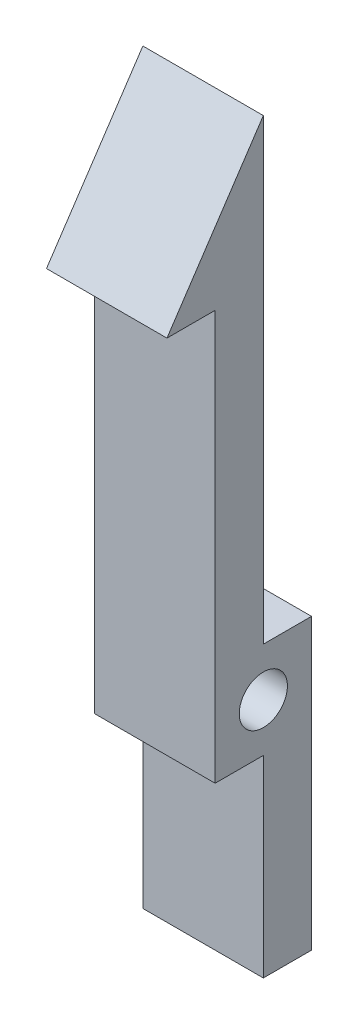
ISO-10303-21;
HEADER;
FILE_DESCRIPTION(('STEP AP214'),'2;1');
FILE_NAME('part.step','',(''),(''),'','','');
FILE_SCHEMA(('AUTOMOTIVE_DESIGN { 1 0 10303 214 1 1 1 1 }'));
ENDSEC;
DATA;
#1=APPLICATION_CONTEXT('core data for automotive mechanical design processes');
#2=APPLICATION_PROTOCOL_DEFINITION('international standard','automotive_design',2000,#1);
#3=PRODUCT_CONTEXT('',#1,'mechanical');
#4=PRODUCT('Part','Part','',(#3));
#5=PRODUCT_RELATED_PRODUCT_CATEGORY('part','',(#4));
#6=PRODUCT_DEFINITION_FORMATION('','',#4);
#7=PRODUCT_DEFINITION_CONTEXT('part definition',#1,'design');
#8=PRODUCT_DEFINITION('design','',#6,#7);
#9=PRODUCT_DEFINITION_SHAPE('','',#8);
#10=(LENGTH_UNIT() NAMED_UNIT(*) SI_UNIT(.MILLI.,.METRE.));
#11=(NAMED_UNIT(*) PLANE_ANGLE_UNIT() SI_UNIT($,.RADIAN.));
#12=(NAMED_UNIT(*) SI_UNIT($,.STERADIAN.) SOLID_ANGLE_UNIT());
#13=UNCERTAINTY_MEASURE_WITH_UNIT(LENGTH_MEASURE(1.E-05),#10,'distance_accuracy_value','');
#14=(GEOMETRIC_REPRESENTATION_CONTEXT(3) GLOBAL_UNCERTAINTY_ASSIGNED_CONTEXT((#13)) GLOBAL_UNIT_ASSIGNED_CONTEXT((#10,
#11,#12)) REPRESENTATION_CONTEXT('',''));
#15=CARTESIAN_POINT('',(0.,0.,0.));
#16=DIRECTION('',(0.,0.,1.));
#17=DIRECTION('',(1.,0.,0.));
#18=AXIS2_PLACEMENT_3D('',#15,#16,#17);
#19=CARTESIAN_POINT('',(-2.5,15.,4.));
#20=DIRECTION('',(0.,-1.,0.));
#21=DIRECTION('',(0.,0.,-1.));
#22=AXIS2_PLACEMENT_3D('',#19,#20,#21);
#23=PLANE('',#22);
#24=DIRECTION('',(0.,0.,-1.));
#25=VECTOR('',#24,1.);
#26=CARTESIAN_POINT('',(2.5,15.,4.));
#27=LINE('',#26,#25);
#28=CARTESIAN_POINT('',(2.5,15.,4.));
#29=VERTEX_POINT('',#28);
#30=CARTESIAN_POINT('',(2.5,15.,2.));
#31=VERTEX_POINT('',#30);
#32=EDGE_CURVE('E134',#29,#31,#27,.T.);
#33=ORIENTED_EDGE('',*,*,#32,.F.);
#34=DIRECTION('',(1.,0.,0.));
#35=VECTOR('',#34,1.);
#36=CARTESIAN_POINT('',(-2.5,15.,4.));
#37=LINE('',#36,#35);
#38=CARTESIAN_POINT('',(-2.5,15.,4.));
#39=VERTEX_POINT('',#38);
#40=EDGE_CURVE('E11',#39,#29,#37,.T.);
#41=ORIENTED_EDGE('',*,*,#40,.F.);
#42=DIRECTION('',(0.,0.,-1.));
#43=VECTOR('',#42,1.);
#44=CARTESIAN_POINT('',(-2.5,15.,4.));
#45=LINE('',#44,#43);
#46=CARTESIAN_POINT('',(-2.5,15.,2.));
#47=VERTEX_POINT('',#46);
#48=EDGE_CURVE('E158',#39,#47,#45,.T.);
#49=ORIENTED_EDGE('',*,*,#48,.T.);
#50=DIRECTION('',(1.,0.,0.));
#51=VECTOR('',#50,1.);
#52=CARTESIAN_POINT('',(-2.5,15.,2.));
#53=LINE('',#52,#51);
#54=EDGE_CURVE('E34',#47,#31,#53,.T.);
#55=ORIENTED_EDGE('',*,*,#54,.T.);
#56=EDGE_LOOP('',(#33,#41,#49,#55));
#57=FACE_BOUND('',#56,.T.);
#58=ADVANCED_FACE('F31',(#57),#23,.T.);
#59=CARTESIAN_POINT('',(-2.5,21.,0.));
#60=DIRECTION('',(0.,0.554700196225229,0.832050294337843));
#61=DIRECTION('',(0.,-0.832050294337843,0.554700196225229));
#62=AXIS2_PLACEMENT_3D('',#59,#60,#61);
#63=PLANE('',#62);
#64=DIRECTION('',(0.,-0.832050294337844,0.554700196225229));
#65=VECTOR('',#64,1.);
#66=CARTESIAN_POINT('',(2.5,21.,0.));
#67=LINE('',#66,#65);
#68=CARTESIAN_POINT('',(2.5,21.,0.));
#69=VERTEX_POINT('',#68);
#70=EDGE_CURVE('E156',#69,#29,#67,.T.);
#71=ORIENTED_EDGE('',*,*,#70,.F.);
#72=DIRECTION('',(1.,0.,0.));
#73=VECTOR('',#72,1.);
#74=CARTESIAN_POINT('',(-2.5,21.,0.));
#75=LINE('',#74,#73);
#76=CARTESIAN_POINT('',(-2.5,21.,0.));
#77=VERTEX_POINT('',#76);
#78=EDGE_CURVE('E40',#77,#69,#75,.T.);
#79=ORIENTED_EDGE('',*,*,#78,.F.);
#80=DIRECTION('',(0.,-0.832050294337844,0.554700196225229));
#81=VECTOR('',#80,1.);
#82=CARTESIAN_POINT('',(-2.5,21.,0.));
#83=LINE('',#82,#81);
#84=EDGE_CURVE('E124',#77,#39,#83,.T.);
#85=ORIENTED_EDGE('',*,*,#84,.T.);
#86=ORIENTED_EDGE('',*,*,#40,.T.);
#87=EDGE_LOOP('',(#71,#79,#85,#86));
#88=FACE_BOUND('',#87,.T.);
#89=ADVANCED_FACE('F172',(#88),#63,.T.);
#90=CARTESIAN_POINT('',(-2.5,2.,0.));
#91=DIRECTION('',(0.,0.,-1.));
#92=DIRECTION('',(-1.,0.,0.));
#93=AXIS2_PLACEMENT_3D('',#90,#91,#92);
#94=PLANE('',#93);
#95=DIRECTION('',(0.,1.,0.));
#96=VECTOR('',#95,1.);
#97=CARTESIAN_POINT('',(2.5,2.,0.));
#98=LINE('',#97,#96);
#99=CARTESIAN_POINT('',(2.5,2.,0.));
#100=VERTEX_POINT('',#99);
#101=EDGE_CURVE('E111',#100,#69,#98,.T.);
#102=ORIENTED_EDGE('',*,*,#101,.F.);
#103=DIRECTION('',(1.,0.,0.));
#104=VECTOR('',#103,1.);
#105=CARTESIAN_POINT('',(-2.5,2.,0.));
#106=LINE('',#105,#104);
#107=CARTESIAN_POINT('',(-2.5,2.,0.));
#108=VERTEX_POINT('',#107);
#109=EDGE_CURVE('E106',#108,#100,#106,.T.);
#110=ORIENTED_EDGE('',*,*,#109,.F.);
#111=DIRECTION('',(0.,1.,0.));
#112=VECTOR('',#111,1.);
#113=CARTESIAN_POINT('',(-2.5,2.,0.));
#114=LINE('',#113,#112);
#115=EDGE_CURVE('E109',#108,#77,#114,.T.);
#116=ORIENTED_EDGE('',*,*,#115,.T.);
#117=ORIENTED_EDGE('',*,*,#78,.T.);
#118=EDGE_LOOP('',(#102,#110,#116,#117));
#119=FACE_BOUND('',#118,.T.);
#120=ADVANCED_FACE('F108',(#119),#94,.T.);
#121=CARTESIAN_POINT('',(-2.5,2.,-2.));
#122=DIRECTION('',(0.,1.,0.));
#123=DIRECTION('',(0.,0.,1.));
#124=AXIS2_PLACEMENT_3D('',#121,#122,#123);
#125=PLANE('',#124);
#126=DIRECTION('',(0.,0.,1.));
#127=VECTOR('',#126,1.);
#128=CARTESIAN_POINT('',(2.5,2.,-2.));
#129=LINE('',#128,#127);
#130=CARTESIAN_POINT('',(2.5,2.,-2.));
#131=VERTEX_POINT('',#130);
#132=EDGE_CURVE('E153',#131,#100,#129,.T.);
#133=ORIENTED_EDGE('',*,*,#132,.F.);
#134=DIRECTION('',(1.,0.,0.));
#135=VECTOR('',#134,1.);
#136=CARTESIAN_POINT('',(-2.5,2.,-2.));
#137=LINE('',#136,#135);
#138=CARTESIAN_POINT('',(-2.5,2.,-2.));
#139=VERTEX_POINT('',#138);
#140=EDGE_CURVE('E116',#139,#131,#137,.T.);
#141=ORIENTED_EDGE('',*,*,#140,.F.);
#142=DIRECTION('',(0.,0.,1.));
#143=VECTOR('',#142,1.);
#144=CARTESIAN_POINT('',(-2.5,2.,-2.));
#145=LINE('',#144,#143);
#146=EDGE_CURVE('E122',#139,#108,#145,.T.);
#147=ORIENTED_EDGE('',*,*,#146,.T.);
#148=ORIENTED_EDGE('',*,*,#109,.T.);
#149=EDGE_LOOP('',(#133,#141,#147,#148));
#150=FACE_BOUND('',#149,.T.);
#151=ADVANCED_FACE('F126',(#150),#125,.T.);
#152=CARTESIAN_POINT('',(-2.5,-10.,-2.));
#153=DIRECTION('',(0.,0.,-1.));
#154=DIRECTION('',(-1.,0.,0.));
#155=AXIS2_PLACEMENT_3D('',#152,#153,#154);
#156=PLANE('',#155);
#157=DIRECTION('',(0.,1.,0.));
#158=VECTOR('',#157,1.);
#159=CARTESIAN_POINT('',(2.5,-10.,-2.));
#160=LINE('',#159,#158);
#161=CARTESIAN_POINT('',(2.5,-10.,-2.));
#162=VERTEX_POINT('',#161);
#163=EDGE_CURVE('E150',#162,#131,#160,.T.);
#164=ORIENTED_EDGE('',*,*,#163,.F.);
#165=DIRECTION('',(1.,0.,0.));
#166=VECTOR('',#165,1.);
#167=CARTESIAN_POINT('',(-2.5,-10.,-2.));
#168=LINE('',#167,#166);
#169=CARTESIAN_POINT('',(-2.5,-10.,-2.));
#170=VERTEX_POINT('',#169);
#171=EDGE_CURVE('E162',#170,#162,#168,.T.);
#172=ORIENTED_EDGE('',*,*,#171,.F.);
#173=DIRECTION('',(0.,1.,0.));
#174=VECTOR('',#173,1.);
#175=CARTESIAN_POINT('',(-2.5,-10.,-2.));
#176=LINE('',#175,#174);
#177=EDGE_CURVE('E127',#170,#139,#176,.T.);
#178=ORIENTED_EDGE('',*,*,#177,.T.);
#179=ORIENTED_EDGE('',*,*,#140,.T.);
#180=EDGE_LOOP('',(#164,#172,#178,#179));
#181=FACE_BOUND('',#180,.T.);
#182=ADVANCED_FACE('F185',(#181),#156,.T.);
#183=CARTESIAN_POINT('',(-2.5,-10.,0.));
#184=DIRECTION('',(0.,-1.,0.));
#185=DIRECTION('',(0.,0.,-1.));
#186=AXIS2_PLACEMENT_3D('',#183,#184,#185);
#187=PLANE('',#186);
#188=DIRECTION('',(0.,0.,-1.));
#189=VECTOR('',#188,1.);
#190=CARTESIAN_POINT('',(2.5,-10.,0.));
#191=LINE('',#190,#189);
#192=CARTESIAN_POINT('',(2.5,-10.,0.));
#193=VERTEX_POINT('',#192);
#194=EDGE_CURVE('E147',#193,#162,#191,.T.);
#195=ORIENTED_EDGE('',*,*,#194,.F.);
#196=DIRECTION('',(1.,0.,0.));
#197=VECTOR('',#196,1.);
#198=CARTESIAN_POINT('',(-2.5,-10.,0.));
#199=LINE('',#198,#197);
#200=CARTESIAN_POINT('',(-2.5,-10.,0.));
#201=VERTEX_POINT('',#200);
#202=EDGE_CURVE('E164',#201,#193,#199,.T.);
#203=ORIENTED_EDGE('',*,*,#202,.F.);
#204=DIRECTION('',(0.,0.,-1.));
#205=VECTOR('',#204,1.);
#206=CARTESIAN_POINT('',(-2.5,-10.,0.));
#207=LINE('',#206,#205);
#208=EDGE_CURVE('E129',#201,#170,#207,.T.);
#209=ORIENTED_EDGE('',*,*,#208,.T.);
#210=ORIENTED_EDGE('',*,*,#171,.T.);
#211=EDGE_LOOP('',(#195,#203,#209,#210));
#212=FACE_BOUND('',#211,.T.);
#213=ADVANCED_FACE('F188',(#212),#187,.T.);
#214=CARTESIAN_POINT('',(-2.5,-2.,0.));
#215=DIRECTION('',(0.,0.,1.));
#216=DIRECTION('',(0.,-1.,0.));
#217=AXIS2_PLACEMENT_3D('',#214,#215,#216);
#218=PLANE('',#217);
#219=DIRECTION('',(0.,-1.,0.));
#220=VECTOR('',#219,1.);
#221=CARTESIAN_POINT('',(2.5,-2.,0.));
#222=LINE('',#221,#220);
#223=CARTESIAN_POINT('',(2.5,-2.,0.));
#224=VERTEX_POINT('',#223);
#225=EDGE_CURVE('E144',#224,#193,#222,.T.);
#226=ORIENTED_EDGE('',*,*,#225,.F.);
#227=DIRECTION('',(1.,0.,0.));
#228=VECTOR('',#227,1.);
#229=CARTESIAN_POINT('',(-2.5,-2.,0.));
#230=LINE('',#229,#228);
#231=CARTESIAN_POINT('',(-2.5,-2.,0.));
#232=VERTEX_POINT('',#231);
#233=EDGE_CURVE('E166',#232,#224,#230,.T.);
#234=ORIENTED_EDGE('',*,*,#233,.F.);
#235=DIRECTION('',(0.,-1.,0.));
#236=VECTOR('',#235,1.);
#237=CARTESIAN_POINT('',(-2.5,-2.,0.));
#238=LINE('',#237,#236);
#239=EDGE_CURVE('E230',#232,#201,#238,.T.);
#240=ORIENTED_EDGE('',*,*,#239,.T.);
#241=ORIENTED_EDGE('',*,*,#202,.T.);
#242=EDGE_LOOP('',(#226,#234,#240,#241));
#243=FACE_BOUND('',#242,.T.);
#244=ADVANCED_FACE('F192',(#243),#218,.T.);
#245=CARTESIAN_POINT('',(-2.5,-2.,2.));
#246=DIRECTION('',(0.,-1.,0.));
#247=DIRECTION('',(0.,0.,-1.));
#248=AXIS2_PLACEMENT_3D('',#245,#246,#247);
#249=PLANE('',#248);
#250=DIRECTION('',(0.,0.,-1.));
#251=VECTOR('',#250,1.);
#252=CARTESIAN_POINT('',(2.5,-2.,2.));
#253=LINE('',#252,#251);
#254=CARTESIAN_POINT('',(2.5,-2.,2.));
#255=VERTEX_POINT('',#254);
#256=EDGE_CURVE('E141',#255,#224,#253,.T.);
#257=ORIENTED_EDGE('',*,*,#256,.F.);
#258=DIRECTION('',(1.,0.,0.));
#259=VECTOR('',#258,1.);
#260=CARTESIAN_POINT('',(-2.5,-2.,2.));
#261=LINE('',#260,#259);
#262=CARTESIAN_POINT('',(-2.5,-2.,2.));
#263=VERTEX_POINT('',#262);
#264=EDGE_CURVE('E167',#263,#255,#261,.T.);
#265=ORIENTED_EDGE('',*,*,#264,.F.);
#266=DIRECTION('',(0.,0.,-1.));
#267=VECTOR('',#266,1.);
#268=CARTESIAN_POINT('',(-2.5,-2.,2.));
#269=LINE('',#268,#267);
#270=EDGE_CURVE('E227',#263,#232,#269,.T.);
#271=ORIENTED_EDGE('',*,*,#270,.T.);
#272=ORIENTED_EDGE('',*,*,#233,.T.);
#273=EDGE_LOOP('',(#257,#265,#271,#272));
#274=FACE_BOUND('',#273,.T.);
#275=ADVANCED_FACE('F196',(#274),#249,.T.);
#276=CARTESIAN_POINT('',(-2.5,15.,2.));
#277=DIRECTION('',(0.,0.,1.));
#278=DIRECTION('',(0.,-1.,0.));
#279=AXIS2_PLACEMENT_3D('',#276,#277,#278);
#280=PLANE('',#279);
#281=DIRECTION('',(0.,-1.,0.));
#282=VECTOR('',#281,1.);
#283=CARTESIAN_POINT('',(2.5,15.,2.));
#284=LINE('',#283,#282);
#285=EDGE_CURVE('E137',#31,#255,#284,.T.);
#286=ORIENTED_EDGE('',*,*,#285,.F.);
#287=ORIENTED_EDGE('',*,*,#54,.F.);
#288=DIRECTION('',(0.,-1.,0.));
#289=VECTOR('',#288,1.);
#290=CARTESIAN_POINT('',(-2.5,15.,2.));
#291=LINE('',#290,#289);
#292=EDGE_CURVE('E225',#47,#263,#291,.T.);
#293=ORIENTED_EDGE('',*,*,#292,.T.);
#294=ORIENTED_EDGE('',*,*,#264,.T.);
#295=EDGE_LOOP('',(#286,#287,#293,#294));
#296=FACE_BOUND('',#295,.T.);
#297=ADVANCED_FACE('F169',(#296),#280,.T.);
#298=CARTESIAN_POINT('',(-2.5,15.,2.));
#299=DIRECTION('',(-1.,0.,0.));
#300=DIRECTION('',(0.,0.,1.));
#301=AXIS2_PLACEMENT_3D('',#298,#299,#300);
#302=PLANE('',#301);
#303=CARTESIAN_POINT('',(-2.5,0.,0.));
#304=DIRECTION('',(1.,0.,0.));
#305=DIRECTION('',(0.,0.,-1.));
#306=AXIS2_PLACEMENT_3D('',#303,#304,#305);
#307=CIRCLE('',#306,1.);
#308=CARTESIAN_POINT('',(-2.5,0.,-1.));
#309=VERTEX_POINT('',#308);
#310=EDGE_CURVE('E138',#309,#309,#307,.T.);
#311=ORIENTED_EDGE('',*,*,#310,.T.);
#312=EDGE_LOOP('',(#311));
#313=FACE_BOUND('',#312,.T.);
#314=ORIENTED_EDGE('',*,*,#48,.F.);
#315=ORIENTED_EDGE('',*,*,#84,.F.);
#316=ORIENTED_EDGE('',*,*,#115,.F.);
#317=ORIENTED_EDGE('',*,*,#146,.F.);
#318=ORIENTED_EDGE('',*,*,#177,.F.);
#319=ORIENTED_EDGE('',*,*,#208,.F.);
#320=ORIENTED_EDGE('',*,*,#239,.F.);
#321=ORIENTED_EDGE('',*,*,#270,.F.);
#322=ORIENTED_EDGE('',*,*,#292,.F.);
#323=EDGE_LOOP('',(#314,#315,#316,#317,#318,#319,#320,#321,#322));
#324=FACE_BOUND('',#323,.T.);
#325=ADVANCED_FACE('F120',(#313,#324),#302,.T.);
#326=CARTESIAN_POINT('',(2.5,15.,2.));
#327=DIRECTION('',(-1.,0.,0.));
#328=DIRECTION('',(0.,0.,1.));
#329=AXIS2_PLACEMENT_3D('',#326,#327,#328);
#330=PLANE('',#329);
#331=CARTESIAN_POINT('',(2.5,0.,0.));
#332=DIRECTION('',(1.,0.,0.));
#333=DIRECTION('',(0.,0.,-1.));
#334=AXIS2_PLACEMENT_3D('',#331,#332,#333);
#335=CIRCLE('',#334,1.);
#336=CARTESIAN_POINT('',(2.5,0.,-1.));
#337=VERTEX_POINT('',#336);
#338=EDGE_CURVE('E220',#337,#337,#335,.T.);
#339=ORIENTED_EDGE('',*,*,#338,.F.);
#340=EDGE_LOOP('',(#339));
#341=FACE_BOUND('',#340,.T.);
#342=ORIENTED_EDGE('',*,*,#32,.T.);
#343=ORIENTED_EDGE('',*,*,#285,.T.);
#344=ORIENTED_EDGE('',*,*,#256,.T.);
#345=ORIENTED_EDGE('',*,*,#225,.T.);
#346=ORIENTED_EDGE('',*,*,#194,.T.);
#347=ORIENTED_EDGE('',*,*,#163,.T.);
#348=ORIENTED_EDGE('',*,*,#132,.T.);
#349=ORIENTED_EDGE('',*,*,#101,.T.);
#350=ORIENTED_EDGE('',*,*,#70,.T.);
#351=EDGE_LOOP('',(#342,#343,#344,#345,#346,#347,#348,#349,#350));
#352=FACE_BOUND('',#351,.T.);
#353=ADVANCED_FACE('F171',(#341,#352),#330,.F.);
#354=CARTESIAN_POINT('',(-2.5,0.,0.));
#355=DIRECTION('',(1.,0.,0.));
#356=DIRECTION('',(0.,0.,-1.));
#357=AXIS2_PLACEMENT_3D('',#354,#355,#356);
#358=CYLINDRICAL_SURFACE('',#357,1.);
#359=ORIENTED_EDGE('',*,*,#310,.F.);
#360=EDGE_LOOP('',(#359));
#361=FACE_BOUND('',#360,.T.);
#362=ORIENTED_EDGE('',*,*,#338,.T.);
#363=EDGE_LOOP('',(#362));
#364=FACE_BOUND('',#363,.T.);
#365=ADVANCED_FACE('F208',(#361,#364),#358,.F.);
#366=CLOSED_SHELL('',(#58,#89,#120,#151,#182,#213,#244,#275,#297,#325,#353,#365));
#367=MANIFOLD_SOLID_BREP('B2',#366);
#368=ADVANCED_BREP_SHAPE_REPRESENTATION('',(#18,#367),#14);
#369=SHAPE_DEFINITION_REPRESENTATION(#9,#368);
ENDSEC;
END-ISO-10303-21;
